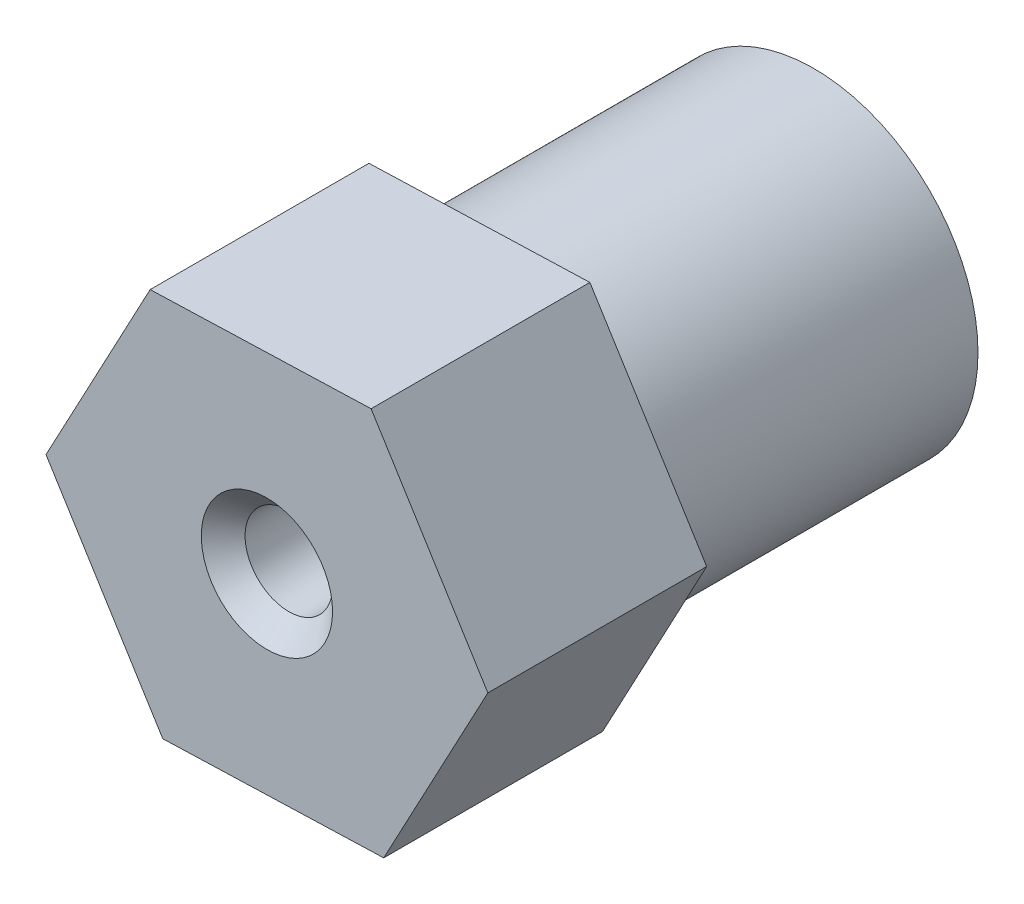
ISO-10303-21;
HEADER;
FILE_DESCRIPTION(('STEP AP214'),'2;1');
FILE_NAME('part.step','',(''),(''),'','','');
FILE_SCHEMA(('AUTOMOTIVE_DESIGN { 1 0 10303 214 1 1 1 1 }'));
ENDSEC;
DATA;
#1=APPLICATION_CONTEXT('core data for automotive mechanical design processes');
#2=APPLICATION_PROTOCOL_DEFINITION('international standard','automotive_design',2000,#1);
#3=PRODUCT_CONTEXT('',#1,'mechanical');
#4=PRODUCT('Part','Part','',(#3));
#5=PRODUCT_RELATED_PRODUCT_CATEGORY('part','',(#4));
#6=PRODUCT_DEFINITION_FORMATION('','',#4);
#7=PRODUCT_DEFINITION_CONTEXT('part definition',#1,'design');
#8=PRODUCT_DEFINITION('design','',#6,#7);
#9=PRODUCT_DEFINITION_SHAPE('','',#8);
#10=(LENGTH_UNIT() NAMED_UNIT(*) SI_UNIT(.MILLI.,.METRE.));
#11=(NAMED_UNIT(*) PLANE_ANGLE_UNIT() SI_UNIT($,.RADIAN.));
#12=(NAMED_UNIT(*) SI_UNIT($,.STERADIAN.) SOLID_ANGLE_UNIT());
#13=UNCERTAINTY_MEASURE_WITH_UNIT(LENGTH_MEASURE(1.E-05),#10,'distance_accuracy_value','');
#14=(GEOMETRIC_REPRESENTATION_CONTEXT(3) GLOBAL_UNCERTAINTY_ASSIGNED_CONTEXT((#13)) GLOBAL_UNIT_ASSIGNED_CONTEXT((#10,
#11,#12)) REPRESENTATION_CONTEXT('',''));
#15=CARTESIAN_POINT('',(0.,0.,0.));
#16=DIRECTION('',(0.,0.,1.));
#17=DIRECTION('',(1.,0.,0.));
#18=AXIS2_PLACEMENT_3D('',#15,#16,#17);
#19=CARTESIAN_POINT('',(0.,0.,0.));
#20=DIRECTION('',(0.,0.,1.));
#21=DIRECTION('',(1.,0.,0.));
#22=AXIS2_PLACEMENT_3D('',#19,#20,#21);
#23=PLANE('',#22);
#24=CARTESIAN_POINT('',(0.,0.,0.));
#25=DIRECTION('',(0.,0.,1.));
#26=DIRECTION('',(1.,0.,0.));
#27=AXIS2_PLACEMENT_3D('',#24,#25,#26);
#28=CIRCLE('',#27,4.7625);
#29=CARTESIAN_POINT('',(4.7625,0.,0.));
#30=VERTEX_POINT('',#29);
#31=EDGE_CURVE('E149',#30,#30,#28,.T.);
#32=ORIENTED_EDGE('',*,*,#31,.F.);
#33=EDGE_LOOP('',(#32));
#34=FACE_BOUND('',#33,.T.);
#35=CARTESIAN_POINT('',(0.,0.,0.));
#36=DIRECTION('',(0.,0.,1.));
#37=DIRECTION('',(1.,0.,0.));
#38=AXIS2_PLACEMENT_3D('',#35,#36,#37);
#39=CIRCLE('',#38,2.54);
#40=CARTESIAN_POINT('',(2.54,0.,0.));
#41=VERTEX_POINT('',#40);
#42=EDGE_CURVE('E146',#41,#41,#39,.T.);
#43=ORIENTED_EDGE('',*,*,#42,.T.);
#44=EDGE_LOOP('',(#43));
#45=FACE_BOUND('',#44,.T.);
#46=ADVANCED_FACE('F37',(#34,#45),#23,.F.);
#47=CARTESIAN_POINT('',(0.,0.,9.525));
#48=DIRECTION('',(0.,0.,-1.));
#49=DIRECTION('',(-1.,0.,0.));
#50=AXIS2_PLACEMENT_3D('',#47,#48,#49);
#51=CYLINDRICAL_SURFACE('',#50,4.7625);
#52=CARTESIAN_POINT('',(0.,0.,9.525));
#53=DIRECTION('',(0.,0.,1.));
#54=DIRECTION('',(1.,0.,0.));
#55=AXIS2_PLACEMENT_3D('',#52,#53,#54);
#56=CIRCLE('',#55,4.7625);
#57=CARTESIAN_POINT('',(4.7625,0.,9.525));
#58=VERTEX_POINT('',#57);
#59=EDGE_CURVE('E150',#58,#58,#56,.T.);
#60=ORIENTED_EDGE('',*,*,#59,.F.);
#61=EDGE_LOOP('',(#60));
#62=FACE_BOUND('',#61,.T.);
#63=ORIENTED_EDGE('',*,*,#31,.T.);
#64=EDGE_LOOP('',(#63));
#65=FACE_BOUND('',#64,.T.);
#66=ADVANCED_FACE('F168',(#62,#65),#51,.T.);
#67=CARTESIAN_POINT('',(0.,0.,9.525));
#68=DIRECTION('',(0.,0.,-1.));
#69=DIRECTION('',(-1.,0.,0.));
#70=AXIS2_PLACEMENT_3D('',#67,#68,#69);
#71=CYLINDRICAL_SURFACE('',#70,2.54);
#72=CARTESIAN_POINT('',(0.,0.,9.525));
#73=DIRECTION('',(0.,0.,1.));
#74=DIRECTION('',(1.,0.,0.));
#75=AXIS2_PLACEMENT_3D('',#72,#73,#74);
#76=CIRCLE('',#75,2.54);
#77=CARTESIAN_POINT('',(2.54,0.,9.525));
#78=VERTEX_POINT('',#77);
#79=EDGE_CURVE('E143',#78,#78,#76,.T.);
#80=ORIENTED_EDGE('',*,*,#79,.T.);
#81=EDGE_LOOP('',(#80));
#82=FACE_BOUND('',#81,.T.);
#83=ORIENTED_EDGE('',*,*,#42,.F.);
#84=EDGE_LOOP('',(#83));
#85=FACE_BOUND('',#84,.T.);
#86=ADVANCED_FACE('F174',(#82,#85),#71,.F.);
#87=CARTESIAN_POINT('',(0.,0.,9.525));
#88=DIRECTION('',(0.,0.,1.));
#89=DIRECTION('',(1.,0.,0.));
#90=AXIS2_PLACEMENT_3D('',#87,#88,#89);
#91=PLANE('',#90);
#92=CARTESIAN_POINT('',(0.,0.,9.525));
#93=DIRECTION('',(0.,0.,1.));
#94=DIRECTION('',(1.,0.,0.));
#95=AXIS2_PLACEMENT_3D('',#92,#93,#94);
#96=CIRCLE('',#95,1.27);
#97=CARTESIAN_POINT('',(1.27,0.,9.525));
#98=VERTEX_POINT('',#97);
#99=EDGE_CURVE('E127',#98,#98,#96,.F.);
#100=ORIENTED_EDGE('',*,*,#99,.F.);
#101=EDGE_LOOP('',(#100));
#102=FACE_BOUND('',#101,.T.);
#103=ORIENTED_EDGE('',*,*,#79,.F.);
#104=EDGE_LOOP('',(#103));
#105=FACE_BOUND('',#104,.T.);
#106=ADVANCED_FACE('F181',(#102,#105),#91,.F.);
#107=DIRECTION('',(-0.528283250765118,0.849068199240226,0.));
#108=VECTOR('',#107,1.);
#109=CARTESIAN_POINT('',(6.41231630756873,0.211545869781084,9.525));
#110=LINE('',#109,#108);
#111=CARTESIAN_POINT('',(6.41231630756873,0.211545869781084,9.525));
#112=VERTEX_POINT('',#111);
#113=CARTESIAN_POINT('',(3.02295405648827,5.65900175434629,9.525));
#114=VERTEX_POINT('',#113);
#115=EDGE_CURVE('E123',#112,#114,#110,.T.);
#116=ORIENTED_EDGE('',*,*,#115,.F.);
#117=DIRECTION('',(0.471173004704983,0.88204081517653,0.));
#118=VECTOR('',#117,1.);
#119=CARTESIAN_POINT('',(3.38936225108046,-5.44745588456521,9.525));
#120=LINE('',#119,#118);
#121=CARTESIAN_POINT('',(3.38936225108046,-5.44745588456521,9.525));
#122=VERTEX_POINT('',#121);
#123=EDGE_CURVE('E83',#122,#112,#120,.T.);
#124=ORIENTED_EDGE('',*,*,#123,.F.);
#125=DIRECTION('',(0.999456255470102,0.0329726159363046,0.));
#126=VECTOR('',#125,1.);
#127=CARTESIAN_POINT('',(-3.02295405648827,-5.65900175434629,9.525));
#128=LINE('',#127,#126);
#129=CARTESIAN_POINT('',(-3.02295405648827,-5.65900175434629,9.525));
#130=VERTEX_POINT('',#129);
#131=EDGE_CURVE('E77',#130,#122,#128,.T.);
#132=ORIENTED_EDGE('',*,*,#131,.F.);
#133=DIRECTION('',(0.528283250765118,-0.849068199240225,0.));
#134=VECTOR('',#133,1.);
#135=CARTESIAN_POINT('',(-6.41231630756873,-0.211545869781084,9.525));
#136=LINE('',#135,#134);
#137=CARTESIAN_POINT('',(-6.41231630756873,-0.211545869781084,9.525));
#138=VERTEX_POINT('',#137);
#139=EDGE_CURVE('E113',#138,#130,#136,.T.);
#140=ORIENTED_EDGE('',*,*,#139,.F.);
#141=DIRECTION('',(-0.471173004704983,-0.88204081517653,0.));
#142=VECTOR('',#141,1.);
#143=CARTESIAN_POINT('',(-3.38936225108046,5.44745588456521,9.525));
#144=LINE('',#143,#142);
#145=CARTESIAN_POINT('',(-3.38936225108046,5.44745588456521,9.525));
#146=VERTEX_POINT('',#145);
#147=EDGE_CURVE('E129',#146,#138,#144,.T.);
#148=ORIENTED_EDGE('',*,*,#147,.F.);
#149=DIRECTION('',(-0.999456255470102,-0.0329726159363049,0.));
#150=VECTOR('',#149,1.);
#151=CARTESIAN_POINT('',(3.02295405648827,5.65900175434629,9.525));
#152=LINE('',#151,#150);
#153=EDGE_CURVE('E126',#114,#146,#152,.T.);
#154=ORIENTED_EDGE('',*,*,#153,.F.);
#155=EDGE_LOOP('',(#116,#124,#132,#140,#148,#154));
#156=FACE_BOUND('',#155,.T.);
#157=ORIENTED_EDGE('',*,*,#59,.T.);
#158=EDGE_LOOP('',(#157));
#159=FACE_BOUND('',#158,.T.);
#160=ADVANCED_FACE('F187',(#156,#159),#91,.F.);
#161=CARTESIAN_POINT('',(6.41231630756873,0.211545869781084,15.875));
#162=DIRECTION('',(-0.849068199240225,-0.528283250765118,0.));
#163=DIRECTION('',(0.528283250765118,-0.849068199240226,0.));
#164=AXIS2_PLACEMENT_3D('',#161,#162,#163);
#165=PLANE('',#164);
#166=ORIENTED_EDGE('',*,*,#115,.T.);
#167=DIRECTION('',(0.,0.,-1.));
#168=VECTOR('',#167,1.);
#169=CARTESIAN_POINT('',(3.02295405648827,5.65900175434629,15.875));
#170=LINE('',#169,#168);
#171=CARTESIAN_POINT('',(3.02295405648827,5.65900175434629,15.875));
#172=VERTEX_POINT('',#171);
#173=EDGE_CURVE('E141',#172,#114,#170,.T.);
#174=ORIENTED_EDGE('',*,*,#173,.F.);
#175=DIRECTION('',(-0.528283250765118,0.849068199240226,0.));
#176=VECTOR('',#175,1.);
#177=CARTESIAN_POINT('',(6.41231630756873,0.211545869781084,15.875));
#178=LINE('',#177,#176);
#179=CARTESIAN_POINT('',(6.41231630756873,0.211545869781084,15.875));
#180=VERTEX_POINT('',#179);
#181=EDGE_CURVE('E134',#180,#172,#178,.T.);
#182=ORIENTED_EDGE('',*,*,#181,.F.);
#183=DIRECTION('',(0.,0.,-1.));
#184=VECTOR('',#183,1.);
#185=CARTESIAN_POINT('',(6.41231630756873,0.211545869781084,15.875));
#186=LINE('',#185,#184);
#187=EDGE_CURVE('E119',#180,#112,#186,.T.);
#188=ORIENTED_EDGE('',*,*,#187,.T.);
#189=EDGE_LOOP('',(#166,#174,#182,#188));
#190=FACE_BOUND('',#189,.T.);
#191=ADVANCED_FACE('F183',(#190),#165,.F.);
#192=CARTESIAN_POINT('',(3.02295405648827,5.65900175434629,15.875));
#193=DIRECTION('',(0.0329726159363049,-0.999456255470102,0.));
#194=DIRECTION('',(0.999456255470102,0.0329726159363049,0.));
#195=AXIS2_PLACEMENT_3D('',#192,#193,#194);
#196=PLANE('',#195);
#197=ORIENTED_EDGE('',*,*,#153,.T.);
#198=DIRECTION('',(0.,0.,-1.));
#199=VECTOR('',#198,1.);
#200=CARTESIAN_POINT('',(-3.38936225108046,5.44745588456521,15.875));
#201=LINE('',#200,#199);
#202=CARTESIAN_POINT('',(-3.38936225108046,5.44745588456521,15.875));
#203=VERTEX_POINT('',#202);
#204=EDGE_CURVE('E138',#203,#146,#201,.T.);
#205=ORIENTED_EDGE('',*,*,#204,.F.);
#206=DIRECTION('',(-0.999456255470102,-0.0329726159363049,0.));
#207=VECTOR('',#206,1.);
#208=CARTESIAN_POINT('',(3.02295405648827,5.65900175434629,15.875));
#209=LINE('',#208,#207);
#210=EDGE_CURVE('E92',#172,#203,#209,.T.);
#211=ORIENTED_EDGE('',*,*,#210,.F.);
#212=ORIENTED_EDGE('',*,*,#173,.T.);
#213=EDGE_LOOP('',(#197,#205,#211,#212));
#214=FACE_BOUND('',#213,.T.);
#215=ADVANCED_FACE('F186',(#214),#196,.F.);
#216=CARTESIAN_POINT('',(-3.38936225108046,5.44745588456521,15.875));
#217=DIRECTION('',(0.88204081517653,-0.471173004704983,0.));
#218=DIRECTION('',(0.471173004704983,0.88204081517653,0.));
#219=AXIS2_PLACEMENT_3D('',#216,#217,#218);
#220=PLANE('',#219);
#221=ORIENTED_EDGE('',*,*,#147,.T.);
#222=DIRECTION('',(0.,0.,-1.));
#223=VECTOR('',#222,1.);
#224=CARTESIAN_POINT('',(-6.41231630756873,-0.211545869781084,15.875));
#225=LINE('',#224,#223);
#226=CARTESIAN_POINT('',(-6.41231630756873,-0.211545869781084,15.875));
#227=VERTEX_POINT('',#226);
#228=EDGE_CURVE('E114',#227,#138,#225,.T.);
#229=ORIENTED_EDGE('',*,*,#228,.F.);
#230=DIRECTION('',(-0.471173004704983,-0.88204081517653,0.));
#231=VECTOR('',#230,1.);
#232=CARTESIAN_POINT('',(-3.38936225108046,5.44745588456521,15.875));
#233=LINE('',#232,#231);
#234=EDGE_CURVE('E105',#203,#227,#233,.T.);
#235=ORIENTED_EDGE('',*,*,#234,.F.);
#236=ORIENTED_EDGE('',*,*,#204,.T.);
#237=EDGE_LOOP('',(#221,#229,#235,#236));
#238=FACE_BOUND('',#237,.T.);
#239=ADVANCED_FACE('F191',(#238),#220,.F.);
#240=CARTESIAN_POINT('',(-6.41231630756873,-0.211545869781084,15.875));
#241=DIRECTION('',(0.849068199240226,0.528283250765118,0.));
#242=DIRECTION('',(-0.528283250765118,0.849068199240226,0.));
#243=AXIS2_PLACEMENT_3D('',#240,#241,#242);
#244=PLANE('',#243);
#245=ORIENTED_EDGE('',*,*,#139,.T.);
#246=DIRECTION('',(0.,0.,-1.));
#247=VECTOR('',#246,1.);
#248=CARTESIAN_POINT('',(-3.02295405648827,-5.65900175434629,15.875));
#249=LINE('',#248,#247);
#250=CARTESIAN_POINT('',(-3.02295405648827,-5.65900175434629,15.875));
#251=VERTEX_POINT('',#250);
#252=EDGE_CURVE('E110',#251,#130,#249,.T.);
#253=ORIENTED_EDGE('',*,*,#252,.F.);
#254=DIRECTION('',(0.528283250765118,-0.849068199240225,0.));
#255=VECTOR('',#254,1.);
#256=CARTESIAN_POINT('',(-6.41231630756873,-0.211545869781084,15.875));
#257=LINE('',#256,#255);
#258=EDGE_CURVE('E99',#227,#251,#257,.T.);
#259=ORIENTED_EDGE('',*,*,#258,.F.);
#260=ORIENTED_EDGE('',*,*,#228,.T.);
#261=EDGE_LOOP('',(#245,#253,#259,#260));
#262=FACE_BOUND('',#261,.T.);
#263=ADVANCED_FACE('F111',(#262),#244,.F.);
#264=CARTESIAN_POINT('',(-3.02295405648827,-5.65900175434629,15.875));
#265=DIRECTION('',(-0.0329726159363046,0.999456255470102,0.));
#266=DIRECTION('',(-0.999456255470102,-0.0329726159363046,0.));
#267=AXIS2_PLACEMENT_3D('',#264,#265,#266);
#268=PLANE('',#267);
#269=ORIENTED_EDGE('',*,*,#131,.T.);
#270=DIRECTION('',(0.,0.,-1.));
#271=VECTOR('',#270,1.);
#272=CARTESIAN_POINT('',(3.38936225108046,-5.44745588456521,15.875));
#273=LINE('',#272,#271);
#274=CARTESIAN_POINT('',(3.38936225108046,-5.44745588456521,15.875));
#275=VERTEX_POINT('',#274);
#276=EDGE_CURVE('E115',#275,#122,#273,.T.);
#277=ORIENTED_EDGE('',*,*,#276,.F.);
#278=DIRECTION('',(0.999456255470102,0.0329726159363046,0.));
#279=VECTOR('',#278,1.);
#280=CARTESIAN_POINT('',(-3.02295405648827,-5.65900175434629,15.875));
#281=LINE('',#280,#279);
#282=EDGE_CURVE('E103',#251,#275,#281,.T.);
#283=ORIENTED_EDGE('',*,*,#282,.F.);
#284=ORIENTED_EDGE('',*,*,#252,.T.);
#285=EDGE_LOOP('',(#269,#277,#283,#284));
#286=FACE_BOUND('',#285,.T.);
#287=ADVANCED_FACE('F117',(#286),#268,.F.);
#288=CARTESIAN_POINT('',(3.38936225108046,-5.44745588456521,15.875));
#289=DIRECTION('',(-0.88204081517653,0.471173004704983,0.));
#290=DIRECTION('',(-0.471173004704983,-0.88204081517653,0.));
#291=AXIS2_PLACEMENT_3D('',#288,#289,#290);
#292=PLANE('',#291);
#293=ORIENTED_EDGE('',*,*,#123,.T.);
#294=ORIENTED_EDGE('',*,*,#187,.F.);
#295=DIRECTION('',(0.471173004704983,0.88204081517653,0.));
#296=VECTOR('',#295,1.);
#297=CARTESIAN_POINT('',(3.38936225108046,-5.44745588456521,15.875));
#298=LINE('',#297,#296);
#299=EDGE_CURVE('E54',#275,#180,#298,.T.);
#300=ORIENTED_EDGE('',*,*,#299,.F.);
#301=ORIENTED_EDGE('',*,*,#276,.T.);
#302=EDGE_LOOP('',(#293,#294,#300,#301));
#303=FACE_BOUND('',#302,.T.);
#304=ADVANCED_FACE('F199',(#303),#292,.F.);
#305=CARTESIAN_POINT('',(0.,0.,15.875));
#306=DIRECTION('',(0.,0.,1.));
#307=DIRECTION('',(1.,0.,0.));
#308=AXIS2_PLACEMENT_3D('',#305,#306,#307);
#309=PLANE('',#308);
#310=CARTESIAN_POINT('',(0.,0.,15.875));
#311=DIRECTION('',(0.,0.,1.));
#312=DIRECTION('',(1.,0.,0.));
#313=AXIS2_PLACEMENT_3D('',#310,#311,#312);
#314=CIRCLE('',#313,1.90500000000001);
#315=CARTESIAN_POINT('',(1.90500000000001,0.,15.875));
#316=VERTEX_POINT('',#315);
#317=EDGE_CURVE('E11',#316,#316,#314,.F.);
#318=ORIENTED_EDGE('',*,*,#317,.T.);
#319=EDGE_LOOP('',(#318));
#320=FACE_BOUND('',#319,.T.);
#321=ORIENTED_EDGE('',*,*,#181,.T.);
#322=ORIENTED_EDGE('',*,*,#210,.T.);
#323=ORIENTED_EDGE('',*,*,#234,.T.);
#324=ORIENTED_EDGE('',*,*,#258,.T.);
#325=ORIENTED_EDGE('',*,*,#282,.T.);
#326=ORIENTED_EDGE('',*,*,#299,.T.);
#327=EDGE_LOOP('',(#321,#322,#323,#324,#325,#326));
#328=FACE_BOUND('',#327,.T.);
#329=ADVANCED_FACE('F101',(#320,#328),#309,.T.);
#330=CARTESIAN_POINT('',(0.,0.,-0.001000000000001));
#331=DIRECTION('',(0.,0.,1.));
#332=DIRECTION('',(1.,0.,0.));
#333=AXIS2_PLACEMENT_3D('',#330,#331,#332);
#334=CYLINDRICAL_SURFACE('',#333,1.27);
#335=CARTESIAN_POINT('',(0.,0.,15.24));
#336=DIRECTION('',(0.,0.,1.));
#337=DIRECTION('',(1.,0.,0.));
#338=AXIS2_PLACEMENT_3D('',#335,#336,#337);
#339=CIRCLE('',#338,1.27);
#340=CARTESIAN_POINT('',(1.27,0.,15.24));
#341=VERTEX_POINT('',#340);
#342=EDGE_CURVE('E46',#341,#341,#339,.T.);
#343=ORIENTED_EDGE('',*,*,#342,.T.);
#344=EDGE_LOOP('',(#343));
#345=FACE_BOUND('',#344,.T.);
#346=ORIENTED_EDGE('',*,*,#99,.T.);
#347=EDGE_LOOP('',(#346));
#348=FACE_BOUND('',#347,.T.);
#349=ADVANCED_FACE('F157',(#345,#348),#334,.F.);
#350=CARTESIAN_POINT('',(0.,0.,15.24));
#351=DIRECTION('',(0.,0.,1.));
#352=DIRECTION('',(1.,0.,0.));
#353=AXIS2_PLACEMENT_3D('',#350,#351,#352);
#354=CONICAL_SURFACE('',#353,1.27,0.785398163397451);
#355=ORIENTED_EDGE('',*,*,#317,.F.);
#356=EDGE_LOOP('',(#355));
#357=FACE_BOUND('',#356,.T.);
#358=ORIENTED_EDGE('',*,*,#342,.F.);
#359=EDGE_LOOP('',(#358));
#360=FACE_BOUND('',#359,.T.);
#361=ADVANCED_FACE('F39',(#357,#360),#354,.F.);
#362=CLOSED_SHELL('',(#46,#66,#86,#106,#160,#191,#215,#239,#263,#287,#304,#329,#349,#361));
#363=MANIFOLD_SOLID_BREP('B2',#362);
#364=ADVANCED_BREP_SHAPE_REPRESENTATION('',(#18,#363),#14);
#365=SHAPE_DEFINITION_REPRESENTATION(#9,#364);
ENDSEC;
END-ISO-10303-21;
